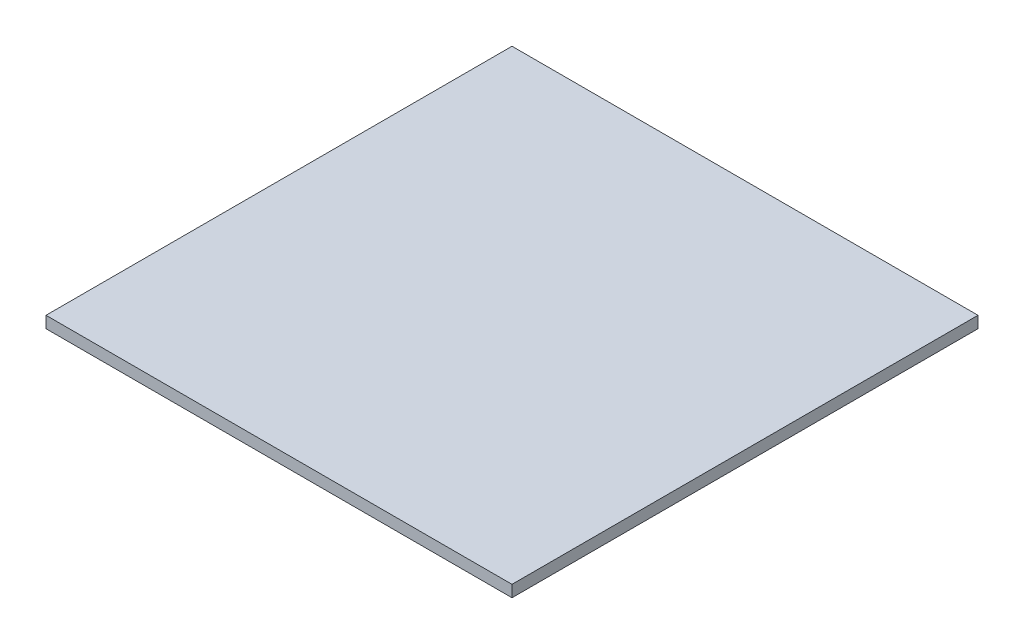
ISO-10303-21;
HEADER;
FILE_DESCRIPTION(('STEP AP214'),'2;1');
FILE_NAME('part.step','',(''),(''),'','','');
FILE_SCHEMA(('AUTOMOTIVE_DESIGN { 1 0 10303 214 1 1 1 1 }'));
ENDSEC;
DATA;
#1=APPLICATION_CONTEXT('core data for automotive mechanical design processes');
#2=APPLICATION_PROTOCOL_DEFINITION('international standard','automotive_design',2000,#1);
#3=PRODUCT_CONTEXT('',#1,'mechanical');
#4=PRODUCT('Part','Part','',(#3));
#5=PRODUCT_RELATED_PRODUCT_CATEGORY('part','',(#4));
#6=PRODUCT_DEFINITION_FORMATION('','',#4);
#7=PRODUCT_DEFINITION_CONTEXT('part definition',#1,'design');
#8=PRODUCT_DEFINITION('design','',#6,#7);
#9=PRODUCT_DEFINITION_SHAPE('','',#8);
#10=(LENGTH_UNIT() NAMED_UNIT(*) SI_UNIT(.MILLI.,.METRE.));
#11=(NAMED_UNIT(*) PLANE_ANGLE_UNIT() SI_UNIT($,.RADIAN.));
#12=(NAMED_UNIT(*) SI_UNIT($,.STERADIAN.) SOLID_ANGLE_UNIT());
#13=UNCERTAINTY_MEASURE_WITH_UNIT(LENGTH_MEASURE(1.E-05),#10,'distance_accuracy_value','');
#14=(GEOMETRIC_REPRESENTATION_CONTEXT(3) GLOBAL_UNCERTAINTY_ASSIGNED_CONTEXT((#13)) GLOBAL_UNIT_ASSIGNED_CONTEXT((#10,
#11,#12)) REPRESENTATION_CONTEXT('',''));
#15=CARTESIAN_POINT('',(0.,0.,0.));
#16=DIRECTION('',(0.,0.,1.));
#17=DIRECTION('',(1.,0.,0.));
#18=AXIS2_PLACEMENT_3D('',#15,#16,#17);
#19=CARTESIAN_POINT('',(0.,10.,0.));
#20=DIRECTION('',(1.,0.,0.));
#21=DIRECTION('',(0.,0.,-1.));
#22=AXIS2_PLACEMENT_3D('',#19,#20,#21);
#23=PLANE('',#22);
#24=DIRECTION('',(0.,0.,1.));
#25=VECTOR('',#24,1.);
#26=CARTESIAN_POINT('',(0.,0.,0.));
#27=LINE('',#26,#25);
#28=CARTESIAN_POINT('',(0.,0.,-400.));
#29=VERTEX_POINT('',#28);
#30=CARTESIAN_POINT('',(0.,0.,0.));
#31=VERTEX_POINT('',#30);
#32=EDGE_CURVE('E94',#29,#31,#27,.T.);
#33=ORIENTED_EDGE('',*,*,#32,.T.);
#34=DIRECTION('',(0.,-1.,0.));
#35=VECTOR('',#34,1.);
#36=CARTESIAN_POINT('',(0.,10.,0.));
#37=LINE('',#36,#35);
#38=CARTESIAN_POINT('',(0.,10.,0.));
#39=VERTEX_POINT('',#38);
#40=EDGE_CURVE('E11',#39,#31,#37,.T.);
#41=ORIENTED_EDGE('',*,*,#40,.F.);
#42=DIRECTION('',(0.,0.,1.));
#43=VECTOR('',#42,1.);
#44=CARTESIAN_POINT('',(0.,10.,0.));
#45=LINE('',#44,#43);
#46=CARTESIAN_POINT('',(0.,10.,-400.));
#47=VERTEX_POINT('',#46);
#48=EDGE_CURVE('E82',#47,#39,#45,.T.);
#49=ORIENTED_EDGE('',*,*,#48,.F.);
#50=DIRECTION('',(0.,-1.,0.));
#51=VECTOR('',#50,1.);
#52=CARTESIAN_POINT('',(0.,10.,-400.));
#53=LINE('',#52,#51);
#54=EDGE_CURVE('E90',#47,#29,#53,.T.);
#55=ORIENTED_EDGE('',*,*,#54,.T.);
#56=EDGE_LOOP('',(#33,#41,#49,#55));
#57=FACE_BOUND('',#56,.T.);
#58=ADVANCED_FACE('F31',(#57),#23,.F.);
#59=CARTESIAN_POINT('',(0.,10.,0.));
#60=DIRECTION('',(0.,0.,-1.));
#61=DIRECTION('',(-1.,0.,0.));
#62=AXIS2_PLACEMENT_3D('',#59,#60,#61);
#63=PLANE('',#62);
#64=DIRECTION('',(1.,0.,0.));
#65=VECTOR('',#64,1.);
#66=CARTESIAN_POINT('',(0.,0.,0.));
#67=LINE('',#66,#65);
#68=CARTESIAN_POINT('',(400.,0.,0.));
#69=VERTEX_POINT('',#68);
#70=EDGE_CURVE('E86',#31,#69,#67,.T.);
#71=ORIENTED_EDGE('',*,*,#70,.T.);
#72=DIRECTION('',(0.,-1.,0.));
#73=VECTOR('',#72,1.);
#74=CARTESIAN_POINT('',(400.,10.,0.));
#75=LINE('',#74,#73);
#76=CARTESIAN_POINT('',(400.,10.,0.));
#77=VERTEX_POINT('',#76);
#78=EDGE_CURVE('E39',#77,#69,#75,.T.);
#79=ORIENTED_EDGE('',*,*,#78,.F.);
#80=DIRECTION('',(1.,0.,0.));
#81=VECTOR('',#80,1.);
#82=CARTESIAN_POINT('',(0.,10.,0.));
#83=LINE('',#82,#81);
#84=EDGE_CURVE('E77',#39,#77,#83,.T.);
#85=ORIENTED_EDGE('',*,*,#84,.F.);
#86=ORIENTED_EDGE('',*,*,#40,.T.);
#87=EDGE_LOOP('',(#71,#79,#85,#86));
#88=FACE_BOUND('',#87,.T.);
#89=ADVANCED_FACE('F85',(#88),#63,.F.);
#90=CARTESIAN_POINT('',(400.,10.,0.));
#91=DIRECTION('',(-1.,0.,0.));
#92=DIRECTION('',(0.,0.,1.));
#93=AXIS2_PLACEMENT_3D('',#90,#91,#92);
#94=PLANE('',#93);
#95=DIRECTION('',(0.,0.,-1.));
#96=VECTOR('',#95,1.);
#97=CARTESIAN_POINT('',(400.,0.,0.));
#98=LINE('',#97,#96);
#99=CARTESIAN_POINT('',(400.,0.,-400.));
#100=VERTEX_POINT('',#99);
#101=EDGE_CURVE('E64',#69,#100,#98,.T.);
#102=ORIENTED_EDGE('',*,*,#101,.T.);
#103=DIRECTION('',(0.,-1.,0.));
#104=VECTOR('',#103,1.);
#105=CARTESIAN_POINT('',(400.,10.,-400.));
#106=LINE('',#105,#104);
#107=CARTESIAN_POINT('',(400.,10.,-400.));
#108=VERTEX_POINT('',#107);
#109=EDGE_CURVE('E87',#108,#100,#106,.T.);
#110=ORIENTED_EDGE('',*,*,#109,.F.);
#111=DIRECTION('',(0.,0.,-1.));
#112=VECTOR('',#111,1.);
#113=CARTESIAN_POINT('',(400.,10.,0.));
#114=LINE('',#113,#112);
#115=EDGE_CURVE('E80',#77,#108,#114,.T.);
#116=ORIENTED_EDGE('',*,*,#115,.F.);
#117=ORIENTED_EDGE('',*,*,#78,.T.);
#118=EDGE_LOOP('',(#102,#110,#116,#117));
#119=FACE_BOUND('',#118,.T.);
#120=ADVANCED_FACE('F88',(#119),#94,.F.);
#121=CARTESIAN_POINT('',(0.,10.,-400.));
#122=DIRECTION('',(0.,0.,1.));
#123=DIRECTION('',(1.,0.,0.));
#124=AXIS2_PLACEMENT_3D('',#121,#122,#123);
#125=PLANE('',#124);
#126=DIRECTION('',(-1.,0.,0.));
#127=VECTOR('',#126,1.);
#128=CARTESIAN_POINT('',(0.,0.,-400.));
#129=LINE('',#128,#127);
#130=EDGE_CURVE('E70',#100,#29,#129,.T.);
#131=ORIENTED_EDGE('',*,*,#130,.T.);
#132=ORIENTED_EDGE('',*,*,#54,.F.);
#133=DIRECTION('',(-1.,0.,0.));
#134=VECTOR('',#133,1.);
#135=CARTESIAN_POINT('',(0.,10.,-400.));
#136=LINE('',#135,#134);
#137=EDGE_CURVE('E47',#108,#47,#136,.T.);
#138=ORIENTED_EDGE('',*,*,#137,.F.);
#139=ORIENTED_EDGE('',*,*,#109,.T.);
#140=EDGE_LOOP('',(#131,#132,#138,#139));
#141=FACE_BOUND('',#140,.T.);
#142=ADVANCED_FACE('F101',(#141),#125,.F.);
#143=CARTESIAN_POINT('',(0.,10.,-400.));
#144=DIRECTION('',(0.,-1.,0.));
#145=DIRECTION('',(0.,0.,-1.));
#146=AXIS2_PLACEMENT_3D('',#143,#144,#145);
#147=PLANE('',#146);
#148=ORIENTED_EDGE('',*,*,#48,.T.);
#149=ORIENTED_EDGE('',*,*,#84,.T.);
#150=ORIENTED_EDGE('',*,*,#115,.T.);
#151=ORIENTED_EDGE('',*,*,#137,.T.);
#152=EDGE_LOOP('',(#148,#149,#150,#151));
#153=FACE_BOUND('',#152,.T.);
#154=ADVANCED_FACE('F78',(#153),#147,.F.);
#155=CARTESIAN_POINT('',(0.,0.,-400.));
#156=DIRECTION('',(0.,-1.,0.));
#157=DIRECTION('',(0.,0.,-1.));
#158=AXIS2_PLACEMENT_3D('',#155,#156,#157);
#159=PLANE('',#158);
#160=ORIENTED_EDGE('',*,*,#32,.F.);
#161=ORIENTED_EDGE('',*,*,#130,.F.);
#162=ORIENTED_EDGE('',*,*,#101,.F.);
#163=ORIENTED_EDGE('',*,*,#70,.F.);
#164=EDGE_LOOP('',(#160,#161,#162,#163));
#165=FACE_BOUND('',#164,.T.);
#166=ADVANCED_FACE('F104',(#165),#159,.T.);
#167=CLOSED_SHELL('',(#58,#89,#120,#142,#154,#166));
#168=MANIFOLD_SOLID_BREP('B2',#167);
#169=ADVANCED_BREP_SHAPE_REPRESENTATION('',(#18,#168),#14);
#170=SHAPE_DEFINITION_REPRESENTATION(#9,#169);
ENDSEC;
END-ISO-10303-21;
